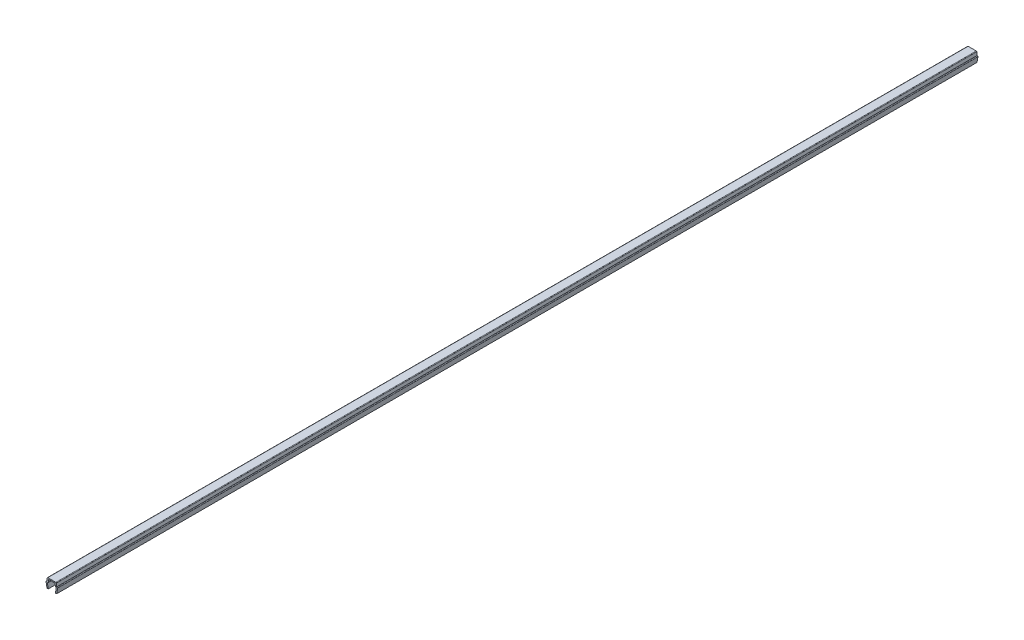
ISO-10303-21;
HEADER;
FILE_DESCRIPTION(('STEP AP214'),'2;1');
FILE_NAME('part.step','',(''),(''),'','','');
FILE_SCHEMA(('AUTOMOTIVE_DESIGN { 1 0 10303 214 1 1 1 1 }'));
ENDSEC;
DATA;
#1=APPLICATION_CONTEXT('core data for automotive mechanical design processes');
#2=APPLICATION_PROTOCOL_DEFINITION('international standard','automotive_design',2000,#1);
#3=PRODUCT_CONTEXT('',#1,'mechanical');
#4=PRODUCT('Part','Part','',(#3));
#5=PRODUCT_RELATED_PRODUCT_CATEGORY('part','',(#4));
#6=PRODUCT_DEFINITION_FORMATION('','',#4);
#7=PRODUCT_DEFINITION_CONTEXT('part definition',#1,'design');
#8=PRODUCT_DEFINITION('design','',#6,#7);
#9=PRODUCT_DEFINITION_SHAPE('','',#8);
#10=(LENGTH_UNIT() NAMED_UNIT(*) SI_UNIT(.MILLI.,.METRE.));
#11=(NAMED_UNIT(*) PLANE_ANGLE_UNIT() SI_UNIT($,.RADIAN.));
#12=(NAMED_UNIT(*) SI_UNIT($,.STERADIAN.) SOLID_ANGLE_UNIT());
#13=UNCERTAINTY_MEASURE_WITH_UNIT(LENGTH_MEASURE(1.E-05),#10,'distance_accuracy_value','');
#14=(GEOMETRIC_REPRESENTATION_CONTEXT(3) GLOBAL_UNCERTAINTY_ASSIGNED_CONTEXT((#13)) GLOBAL_UNIT_ASSIGNED_CONTEXT((#10,
#11,#12)) REPRESENTATION_CONTEXT('',''));
#15=CARTESIAN_POINT('',(0.,0.,0.));
#16=DIRECTION('',(0.,0.,1.));
#17=DIRECTION('',(1.,0.,0.));
#18=AXIS2_PLACEMENT_3D('',#15,#16,#17);
#19=CARTESIAN_POINT('',(-3.25000000000003,3.35000000000003,284.75));
#20=DIRECTION('',(0.,0.,-1.));
#21=DIRECTION('',(-1.,0.,0.));
#22=AXIS2_PLACEMENT_3D('',#19,#20,#21);
#23=CYLINDRICAL_SURFACE('',#22,0.349999999999972);
#24=DIRECTION('',(0.,0.,-1.));
#25=VECTOR('',#24,1.);
#26=CARTESIAN_POINT('',(-3.25,3.7,284.75));
#27=LINE('',#26,#25);
#28=CARTESIAN_POINT('',(-3.25,3.7,284.75));
#29=VERTEX_POINT('',#28);
#30=CARTESIAN_POINT('',(-3.25,3.7,-284.75));
#31=VERTEX_POINT('',#30);
#32=EDGE_CURVE('E211',#29,#31,#27,.T.);
#33=ORIENTED_EDGE('',*,*,#32,.T.);
#34=CARTESIAN_POINT('',(-3.25000000000003,3.35000000000003,-284.75));
#35=DIRECTION('',(0.,0.,1.));
#36=DIRECTION('',(1.,0.,0.));
#37=AXIS2_PLACEMENT_3D('',#34,#35,#36);
#38=CIRCLE('',#37,0.349999999999972);
#39=CARTESIAN_POINT('',(-3.6,3.35,-284.75));
#40=VERTEX_POINT('',#39);
#41=EDGE_CURVE('E205',#31,#40,#38,.T.);
#42=ORIENTED_EDGE('',*,*,#41,.T.);
#43=DIRECTION('',(0.,0.,-1.));
#44=VECTOR('',#43,1.);
#45=CARTESIAN_POINT('',(-3.6,3.35,284.75));
#46=LINE('',#45,#44);
#47=CARTESIAN_POINT('',(-3.6,3.35,284.75));
#48=VERTEX_POINT('',#47);
#49=EDGE_CURVE('E11',#48,#40,#46,.T.);
#50=ORIENTED_EDGE('',*,*,#49,.F.);
#51=CARTESIAN_POINT('',(-3.25000000000003,3.35000000000003,284.75));
#52=DIRECTION('',(0.,0.,1.));
#53=DIRECTION('',(1.,0.,0.));
#54=AXIS2_PLACEMENT_3D('',#51,#52,#53);
#55=CIRCLE('',#54,0.349999999999972);
#56=EDGE_CURVE('E277',#29,#48,#55,.T.);
#57=ORIENTED_EDGE('',*,*,#56,.F.);
#58=EDGE_LOOP('',(#33,#42,#50,#57));
#59=FACE_BOUND('',#58,.T.);
#60=ADVANCED_FACE('F33',(#59),#23,.T.);
#61=CARTESIAN_POINT('',(-3.6,3.35,284.75));
#62=DIRECTION('',(0.984336643247304,0.176299100283099,0.));
#63=DIRECTION('',(-0.176299100283099,0.984336643247304,0.));
#64=AXIS2_PLACEMENT_3D('',#61,#62,#63);
#65=PLANE('',#64);
#66=ORIENTED_EDGE('',*,*,#49,.T.);
#67=DIRECTION('',(0.176299100283099,-0.984336643247304,0.));
#68=VECTOR('',#67,1.);
#69=CARTESIAN_POINT('',(-3.6,3.35,-284.75));
#70=LINE('',#69,#68);
#71=CARTESIAN_POINT('',(-3.,0.,-284.75));
#72=VERTEX_POINT('',#71);
#73=EDGE_CURVE('E195',#40,#72,#70,.T.);
#74=ORIENTED_EDGE('',*,*,#73,.T.);
#75=DIRECTION('',(0.,0.,-1.));
#76=VECTOR('',#75,1.);
#77=CARTESIAN_POINT('',(-3.,0.,284.75));
#78=LINE('',#77,#76);
#79=CARTESIAN_POINT('',(-3.,0.,284.75));
#80=VERTEX_POINT('',#79);
#81=EDGE_CURVE('E40',#80,#72,#78,.T.);
#82=ORIENTED_EDGE('',*,*,#81,.F.);
#83=DIRECTION('',(0.176299100283099,-0.984336643247304,0.));
#84=VECTOR('',#83,1.);
#85=CARTESIAN_POINT('',(-3.6,3.35,284.75));
#86=LINE('',#85,#84);
#87=EDGE_CURVE('E196',#48,#80,#86,.T.);
#88=ORIENTED_EDGE('',*,*,#87,.F.);
#89=EDGE_LOOP('',(#66,#74,#82,#88));
#90=FACE_BOUND('',#89,.T.);
#91=ADVANCED_FACE('F193',(#90),#65,.F.);
#92=CARTESIAN_POINT('',(-3.,0.,284.75));
#93=DIRECTION('',(0.,1.,0.));
#94=DIRECTION('',(0.,0.,1.));
#95=AXIS2_PLACEMENT_3D('',#92,#93,#94);
#96=PLANE('',#95);
#97=ORIENTED_EDGE('',*,*,#81,.T.);
#98=DIRECTION('',(1.,0.,0.));
#99=VECTOR('',#98,1.);
#100=CARTESIAN_POINT('',(-3.,0.,-284.75));
#101=LINE('',#100,#99);
#102=CARTESIAN_POINT('',(-2.2,0.,-284.75));
#103=VERTEX_POINT('',#102);
#104=EDGE_CURVE('E209',#72,#103,#101,.T.);
#105=ORIENTED_EDGE('',*,*,#104,.T.);
#106=DIRECTION('',(0.,0.,-1.));
#107=VECTOR('',#106,1.);
#108=CARTESIAN_POINT('',(-2.2,0.,284.75));
#109=LINE('',#108,#107);
#110=CARTESIAN_POINT('',(-2.2,0.,284.75));
#111=VERTEX_POINT('',#110);
#112=EDGE_CURVE('E363',#111,#103,#109,.T.);
#113=ORIENTED_EDGE('',*,*,#112,.F.);
#114=DIRECTION('',(1.,0.,0.));
#115=VECTOR('',#114,1.);
#116=CARTESIAN_POINT('',(-3.,0.,284.75));
#117=LINE('',#116,#115);
#118=EDGE_CURVE('E280',#80,#111,#117,.T.);
#119=ORIENTED_EDGE('',*,*,#118,.F.);
#120=EDGE_LOOP('',(#97,#105,#113,#119));
#121=FACE_BOUND('',#120,.T.);
#122=ADVANCED_FACE('F366',(#121),#96,.F.);
#123=CARTESIAN_POINT('',(-2.2,0.,284.75));
#124=DIRECTION('',(-0.984336643247306,-0.176299100283088,0.));
#125=DIRECTION('',(0.176299100283088,-0.984336643247306,0.));
#126=AXIS2_PLACEMENT_3D('',#123,#124,#125);
#127=PLANE('',#126);
#128=ORIENTED_EDGE('',*,*,#112,.T.);
#129=DIRECTION('',(-0.176299100283088,0.984336643247306,0.));
#130=VECTOR('',#129,1.);
#131=CARTESIAN_POINT('',(-2.2,0.,-284.75));
#132=LINE('',#131,#130);
#133=CARTESIAN_POINT('',(-2.7352170713255,2.9882953149009,-284.75));
#134=VERTEX_POINT('',#133);
#135=EDGE_CURVE('E215',#103,#134,#132,.T.);
#136=ORIENTED_EDGE('',*,*,#135,.T.);
#137=DIRECTION('',(0.,0.,-1.));
#138=VECTOR('',#137,1.);
#139=CARTESIAN_POINT('',(-2.7352170713255,2.9882953149009,284.75));
#140=LINE('',#139,#138);
#141=CARTESIAN_POINT('',(-2.7352170713255,2.9882953149009,284.75));
#142=VERTEX_POINT('',#141);
#143=EDGE_CURVE('E361',#142,#134,#140,.T.);
#144=ORIENTED_EDGE('',*,*,#143,.F.);
#145=DIRECTION('',(-0.176299100283088,0.984336643247306,0.));
#146=VECTOR('',#145,1.);
#147=CARTESIAN_POINT('',(-2.2,0.,284.75));
#148=LINE('',#147,#146);
#149=EDGE_CURVE('E282',#111,#142,#148,.T.);
#150=ORIENTED_EDGE('',*,*,#149,.F.);
#151=EDGE_LOOP('',(#128,#136,#144,#150));
#152=FACE_BOUND('',#151,.T.);
#153=ADVANCED_FACE('F374',(#152),#127,.F.);
#154=CARTESIAN_POINT('',(-2.390699246189,3.05000000000004,284.75));
#155=DIRECTION('',(0.,0.,-1.));
#156=DIRECTION('',(-1.,0.,0.));
#157=AXIS2_PLACEMENT_3D('',#154,#155,#156);
#158=CYLINDRICAL_SURFACE('',#157,0.349999999999955);
#159=ORIENTED_EDGE('',*,*,#143,.T.);
#160=CARTESIAN_POINT('',(-2.390699246189,3.05000000000004,-284.75));
#161=DIRECTION('',(0.,0.,-1.));
#162=DIRECTION('',(-1.,0.,0.));
#163=AXIS2_PLACEMENT_3D('',#160,#161,#162);
#164=CIRCLE('',#163,0.349999999999955);
#165=CARTESIAN_POINT('',(-2.390699246189,3.4,-284.75));
#166=VERTEX_POINT('',#165);
#167=EDGE_CURVE('E218',#134,#166,#164,.T.);
#168=ORIENTED_EDGE('',*,*,#167,.T.);
#169=DIRECTION('',(0.,0.,-1.));
#170=VECTOR('',#169,1.);
#171=CARTESIAN_POINT('',(-2.390699246189,3.4,284.75));
#172=LINE('',#171,#170);
#173=CARTESIAN_POINT('',(-2.390699246189,3.4,284.75));
#174=VERTEX_POINT('',#173);
#175=EDGE_CURVE('E359',#174,#166,#172,.T.);
#176=ORIENTED_EDGE('',*,*,#175,.F.);
#177=CARTESIAN_POINT('',(-2.390699246189,3.05000000000004,284.75));
#178=DIRECTION('',(0.,0.,-1.));
#179=DIRECTION('',(-1.,0.,0.));
#180=AXIS2_PLACEMENT_3D('',#177,#178,#179);
#181=CIRCLE('',#180,0.349999999999955);
#182=EDGE_CURVE('E284',#142,#174,#181,.T.);
#183=ORIENTED_EDGE('',*,*,#182,.F.);
#184=EDGE_LOOP('',(#159,#168,#176,#183));
#185=FACE_BOUND('',#184,.T.);
#186=ADVANCED_FACE('F377',(#185),#158,.F.);
#187=CARTESIAN_POINT('',(-2.390699246189,3.4,284.75));
#188=DIRECTION('',(0.,1.,0.));
#189=DIRECTION('',(0.,0.,1.));
#190=AXIS2_PLACEMENT_3D('',#187,#188,#189);
#191=PLANE('',#190);
#192=ORIENTED_EDGE('',*,*,#175,.T.);
#193=DIRECTION('',(1.,0.,0.));
#194=VECTOR('',#193,1.);
#195=CARTESIAN_POINT('',(-2.390699246189,3.4,-284.75));
#196=LINE('',#195,#194);
#197=CARTESIAN_POINT('',(-2.2,3.4,-284.75));
#198=VERTEX_POINT('',#197);
#199=EDGE_CURVE('E221',#166,#198,#196,.T.);
#200=ORIENTED_EDGE('',*,*,#199,.T.);
#201=DIRECTION('',(0.,0.,-1.));
#202=VECTOR('',#201,1.);
#203=CARTESIAN_POINT('',(-2.2,3.4,284.75));
#204=LINE('',#203,#202);
#205=CARTESIAN_POINT('',(-2.2,3.4,284.75));
#206=VERTEX_POINT('',#205);
#207=EDGE_CURVE('E357',#206,#198,#204,.T.);
#208=ORIENTED_EDGE('',*,*,#207,.F.);
#209=DIRECTION('',(1.,0.,0.));
#210=VECTOR('',#209,1.);
#211=CARTESIAN_POINT('',(-2.390699246189,3.4,284.75));
#212=LINE('',#211,#210);
#213=EDGE_CURVE('E286',#174,#206,#212,.T.);
#214=ORIENTED_EDGE('',*,*,#213,.F.);
#215=EDGE_LOOP('',(#192,#200,#208,#214));
#216=FACE_BOUND('',#215,.T.);
#217=ADVANCED_FACE('F382',(#216),#191,.F.);
#218=CARTESIAN_POINT('',(-2.2,3.4,284.75));
#219=DIRECTION('',(-0.996194698091743,0.08715574274769,0.));
#220=DIRECTION('',(-0.08715574274769,-0.996194698091743,0.));
#221=AXIS2_PLACEMENT_3D('',#218,#219,#220);
#222=PLANE('',#221);
#223=ORIENTED_EDGE('',*,*,#207,.T.);
#224=DIRECTION('',(0.08715574274769,0.996194698091743,0.));
#225=VECTOR('',#224,1.);
#226=CARTESIAN_POINT('',(-2.2,3.4,-284.75));
#227=LINE('',#226,#225);
#228=CARTESIAN_POINT('',(-2.0704726390793,4.8805045099617,-284.75));
#229=VERTEX_POINT('',#228);
#230=EDGE_CURVE('E224',#198,#229,#227,.T.);
#231=ORIENTED_EDGE('',*,*,#230,.T.);
#232=DIRECTION('',(0.,0.,-1.));
#233=VECTOR('',#232,1.);
#234=CARTESIAN_POINT('',(-2.0704726390793,4.8805045099617,284.75));
#235=LINE('',#234,#233);
#236=CARTESIAN_POINT('',(-2.0704726390793,4.8805045099617,284.75));
#237=VERTEX_POINT('',#236);
#238=EDGE_CURVE('E355',#237,#229,#235,.T.);
#239=ORIENTED_EDGE('',*,*,#238,.F.);
#240=DIRECTION('',(0.08715574274769,0.996194698091743,0.));
#241=VECTOR('',#240,1.);
#242=CARTESIAN_POINT('',(-2.2,3.4,284.75));
#243=LINE('',#242,#241);
#244=EDGE_CURVE('E288',#206,#237,#243,.T.);
#245=ORIENTED_EDGE('',*,*,#244,.F.);
#246=EDGE_LOOP('',(#223,#231,#239,#245));
#247=FACE_BOUND('',#246,.T.);
#248=ADVANCED_FACE('F388',(#247),#222,.F.);
#249=CARTESIAN_POINT('',(-1.72180449474716,4.84999999999996,284.75));
#250=DIRECTION('',(0.,0.,-1.));
#251=DIRECTION('',(-1.,0.,0.));
#252=AXIS2_PLACEMENT_3D('',#249,#250,#251);
#253=CYLINDRICAL_SURFACE('',#252,0.350000000000036);
#254=ORIENTED_EDGE('',*,*,#238,.T.);
#255=CARTESIAN_POINT('',(-1.72180449474716,4.84999999999996,-284.75));
#256=DIRECTION('',(0.,0.,-1.));
#257=DIRECTION('',(-1.,0.,0.));
#258=AXIS2_PLACEMENT_3D('',#255,#256,#257);
#259=CIRCLE('',#258,0.350000000000036);
#260=CARTESIAN_POINT('',(-1.7218044947472,5.2,-284.75));
#261=VERTEX_POINT('',#260);
#262=EDGE_CURVE('E227',#229,#261,#259,.T.);
#263=ORIENTED_EDGE('',*,*,#262,.T.);
#264=DIRECTION('',(0.,0.,-1.));
#265=VECTOR('',#264,1.);
#266=CARTESIAN_POINT('',(-1.7218044947472,5.2,284.75));
#267=LINE('',#266,#265);
#268=CARTESIAN_POINT('',(-1.7218044947472,5.2,284.75));
#269=VERTEX_POINT('',#268);
#270=EDGE_CURVE('E353',#269,#261,#267,.T.);
#271=ORIENTED_EDGE('',*,*,#270,.F.);
#272=CARTESIAN_POINT('',(-1.72180449474716,4.84999999999996,284.75));
#273=DIRECTION('',(0.,0.,-1.));
#274=DIRECTION('',(-1.,0.,0.));
#275=AXIS2_PLACEMENT_3D('',#272,#273,#274);
#276=CIRCLE('',#275,0.350000000000036);
#277=EDGE_CURVE('E290',#237,#269,#276,.T.);
#278=ORIENTED_EDGE('',*,*,#277,.F.);
#279=EDGE_LOOP('',(#254,#263,#271,#278));
#280=FACE_BOUND('',#279,.T.);
#281=ADVANCED_FACE('F392',(#280),#253,.F.);
#282=CARTESIAN_POINT('',(-1.7218044947472,5.2,284.75));
#283=DIRECTION('',(0.,1.,0.));
#284=DIRECTION('',(0.,0.,1.));
#285=AXIS2_PLACEMENT_3D('',#282,#283,#284);
#286=PLANE('',#285);
#287=ORIENTED_EDGE('',*,*,#270,.T.);
#288=DIRECTION('',(1.,0.,0.));
#289=VECTOR('',#288,1.);
#290=CARTESIAN_POINT('',(-1.7218044947472,5.2,-284.75));
#291=LINE('',#290,#289);
#292=CARTESIAN_POINT('',(1.7218044947472,5.2,-284.75));
#293=VERTEX_POINT('',#292);
#294=EDGE_CURVE('E230',#261,#293,#291,.T.);
#295=ORIENTED_EDGE('',*,*,#294,.T.);
#296=DIRECTION('',(0.,0.,-1.));
#297=VECTOR('',#296,1.);
#298=CARTESIAN_POINT('',(1.7218044947472,5.2,284.75));
#299=LINE('',#298,#297);
#300=CARTESIAN_POINT('',(1.7218044947472,5.2,284.75));
#301=VERTEX_POINT('',#300);
#302=EDGE_CURVE('E351',#301,#293,#299,.T.);
#303=ORIENTED_EDGE('',*,*,#302,.F.);
#304=DIRECTION('',(1.,0.,0.));
#305=VECTOR('',#304,1.);
#306=CARTESIAN_POINT('',(-1.7218044947472,5.2,284.75));
#307=LINE('',#306,#305);
#308=EDGE_CURVE('E292',#269,#301,#307,.T.);
#309=ORIENTED_EDGE('',*,*,#308,.F.);
#310=EDGE_LOOP('',(#287,#295,#303,#309));
#311=FACE_BOUND('',#310,.T.);
#312=ADVANCED_FACE('F397',(#311),#286,.F.);
#313=CARTESIAN_POINT('',(1.72180449474716,4.84999999999996,284.75));
#314=DIRECTION('',(0.,0.,-1.));
#315=DIRECTION('',(-1.,0.,0.));
#316=AXIS2_PLACEMENT_3D('',#313,#314,#315);
#317=CYLINDRICAL_SURFACE('',#316,0.350000000000036);
#318=ORIENTED_EDGE('',*,*,#302,.T.);
#319=CARTESIAN_POINT('',(1.72180449474716,4.84999999999996,-284.75));
#320=DIRECTION('',(0.,0.,-1.));
#321=DIRECTION('',(-1.,0.,0.));
#322=AXIS2_PLACEMENT_3D('',#319,#320,#321);
#323=CIRCLE('',#322,0.350000000000036);
#324=CARTESIAN_POINT('',(2.0704726390793,4.8805045099617,-284.75));
#325=VERTEX_POINT('',#324);
#326=EDGE_CURVE('E233',#293,#325,#323,.T.);
#327=ORIENTED_EDGE('',*,*,#326,.T.);
#328=DIRECTION('',(0.,0.,-1.));
#329=VECTOR('',#328,1.);
#330=CARTESIAN_POINT('',(2.0704726390793,4.8805045099617,284.75));
#331=LINE('',#330,#329);
#332=CARTESIAN_POINT('',(2.0704726390793,4.8805045099617,284.75));
#333=VERTEX_POINT('',#332);
#334=EDGE_CURVE('E349',#333,#325,#331,.T.);
#335=ORIENTED_EDGE('',*,*,#334,.F.);
#336=CARTESIAN_POINT('',(1.72180449474716,4.84999999999996,284.75));
#337=DIRECTION('',(0.,0.,-1.));
#338=DIRECTION('',(-1.,0.,0.));
#339=AXIS2_PLACEMENT_3D('',#336,#337,#338);
#340=CIRCLE('',#339,0.350000000000036);
#341=EDGE_CURVE('E294',#301,#333,#340,.T.);
#342=ORIENTED_EDGE('',*,*,#341,.F.);
#343=EDGE_LOOP('',(#318,#327,#335,#342));
#344=FACE_BOUND('',#343,.T.);
#345=ADVANCED_FACE('F403',(#344),#317,.F.);
#346=CARTESIAN_POINT('',(2.0704726390793,4.8805045099617,284.75));
#347=DIRECTION('',(0.996194698091743,0.08715574274769,0.));
#348=DIRECTION('',(-0.08715574274769,0.996194698091743,0.));
#349=AXIS2_PLACEMENT_3D('',#346,#347,#348);
#350=PLANE('',#349);
#351=ORIENTED_EDGE('',*,*,#334,.T.);
#352=DIRECTION('',(0.08715574274769,-0.996194698091743,0.));
#353=VECTOR('',#352,1.);
#354=CARTESIAN_POINT('',(2.0704726390793,4.8805045099617,-284.75));
#355=LINE('',#354,#353);
#356=CARTESIAN_POINT('',(2.2,3.4,-284.75));
#357=VERTEX_POINT('',#356);
#358=EDGE_CURVE('E236',#325,#357,#355,.T.);
#359=ORIENTED_EDGE('',*,*,#358,.T.);
#360=DIRECTION('',(0.,0.,-1.));
#361=VECTOR('',#360,1.);
#362=CARTESIAN_POINT('',(2.2,3.4,284.75));
#363=LINE('',#362,#361);
#364=CARTESIAN_POINT('',(2.2,3.4,284.75));
#365=VERTEX_POINT('',#364);
#366=EDGE_CURVE('E347',#365,#357,#363,.T.);
#367=ORIENTED_EDGE('',*,*,#366,.F.);
#368=DIRECTION('',(0.08715574274769,-0.996194698091743,0.));
#369=VECTOR('',#368,1.);
#370=CARTESIAN_POINT('',(2.0704726390793,4.8805045099617,284.75));
#371=LINE('',#370,#369);
#372=EDGE_CURVE('E296',#333,#365,#371,.T.);
#373=ORIENTED_EDGE('',*,*,#372,.F.);
#374=EDGE_LOOP('',(#351,#359,#367,#373));
#375=FACE_BOUND('',#374,.T.);
#376=ADVANCED_FACE('F407',(#375),#350,.F.);
#377=CARTESIAN_POINT('',(2.2,3.4,284.75));
#378=DIRECTION('',(0.,1.,0.));
#379=DIRECTION('',(0.,0.,1.));
#380=AXIS2_PLACEMENT_3D('',#377,#378,#379);
#381=PLANE('',#380);
#382=ORIENTED_EDGE('',*,*,#366,.T.);
#383=DIRECTION('',(1.,0.,0.));
#384=VECTOR('',#383,1.);
#385=CARTESIAN_POINT('',(2.2,3.4,-284.75));
#386=LINE('',#385,#384);
#387=CARTESIAN_POINT('',(2.390699246189,3.4,-284.75));
#388=VERTEX_POINT('',#387);
#389=EDGE_CURVE('E239',#357,#388,#386,.T.);
#390=ORIENTED_EDGE('',*,*,#389,.T.);
#391=DIRECTION('',(0.,0.,-1.));
#392=VECTOR('',#391,1.);
#393=CARTESIAN_POINT('',(2.390699246189,3.4,284.75));
#394=LINE('',#393,#392);
#395=CARTESIAN_POINT('',(2.390699246189,3.4,284.75));
#396=VERTEX_POINT('',#395);
#397=EDGE_CURVE('E345',#396,#388,#394,.T.);
#398=ORIENTED_EDGE('',*,*,#397,.F.);
#399=DIRECTION('',(1.,0.,0.));
#400=VECTOR('',#399,1.);
#401=CARTESIAN_POINT('',(2.2,3.4,284.75));
#402=LINE('',#401,#400);
#403=EDGE_CURVE('E298',#365,#396,#402,.T.);
#404=ORIENTED_EDGE('',*,*,#403,.F.);
#405=EDGE_LOOP('',(#382,#390,#398,#404));
#406=FACE_BOUND('',#405,.T.);
#407=ADVANCED_FACE('F412',(#406),#381,.F.);
#408=CARTESIAN_POINT('',(2.390699246189,3.05000000000004,284.75));
#409=DIRECTION('',(0.,0.,-1.));
#410=DIRECTION('',(-1.,0.,0.));
#411=AXIS2_PLACEMENT_3D('',#408,#409,#410);
#412=CYLINDRICAL_SURFACE('',#411,0.349999999999955);
#413=ORIENTED_EDGE('',*,*,#397,.T.);
#414=CARTESIAN_POINT('',(2.390699246189,3.05000000000004,-284.75));
#415=DIRECTION('',(0.,0.,-1.));
#416=DIRECTION('',(-1.,0.,0.));
#417=AXIS2_PLACEMENT_3D('',#414,#415,#416);
#418=CIRCLE('',#417,0.349999999999955);
#419=CARTESIAN_POINT('',(2.7352170713255,2.9882953149009,-284.75));
#420=VERTEX_POINT('',#419);
#421=EDGE_CURVE('E242',#388,#420,#418,.T.);
#422=ORIENTED_EDGE('',*,*,#421,.T.);
#423=DIRECTION('',(0.,0.,-1.));
#424=VECTOR('',#423,1.);
#425=CARTESIAN_POINT('',(2.7352170713255,2.9882953149009,284.75));
#426=LINE('',#425,#424);
#427=CARTESIAN_POINT('',(2.7352170713255,2.9882953149009,284.75));
#428=VERTEX_POINT('',#427);
#429=EDGE_CURVE('E343',#428,#420,#426,.T.);
#430=ORIENTED_EDGE('',*,*,#429,.F.);
#431=CARTESIAN_POINT('',(2.390699246189,3.05000000000004,284.75));
#432=DIRECTION('',(0.,0.,-1.));
#433=DIRECTION('',(-1.,0.,0.));
#434=AXIS2_PLACEMENT_3D('',#431,#432,#433);
#435=CIRCLE('',#434,0.349999999999955);
#436=EDGE_CURVE('E300',#396,#428,#435,.T.);
#437=ORIENTED_EDGE('',*,*,#436,.F.);
#438=EDGE_LOOP('',(#413,#422,#430,#437));
#439=FACE_BOUND('',#438,.T.);
#440=ADVANCED_FACE('F418',(#439),#412,.F.);
#441=CARTESIAN_POINT('',(2.7352170713255,2.9882953149009,284.75));
#442=DIRECTION('',(0.984336643247306,-0.176299100283088,0.));
#443=DIRECTION('',(0.176299100283088,0.984336643247306,0.));
#444=AXIS2_PLACEMENT_3D('',#441,#442,#443);
#445=PLANE('',#444);
#446=ORIENTED_EDGE('',*,*,#429,.T.);
#447=DIRECTION('',(-0.176299100283088,-0.984336643247306,0.));
#448=VECTOR('',#447,1.);
#449=CARTESIAN_POINT('',(2.7352170713255,2.9882953149009,-284.75));
#450=LINE('',#449,#448);
#451=CARTESIAN_POINT('',(2.2,0.,-284.75));
#452=VERTEX_POINT('',#451);
#453=EDGE_CURVE('E245',#420,#452,#450,.T.);
#454=ORIENTED_EDGE('',*,*,#453,.T.);
#455=DIRECTION('',(0.,0.,-1.));
#456=VECTOR('',#455,1.);
#457=CARTESIAN_POINT('',(2.2,0.,284.75));
#458=LINE('',#457,#456);
#459=CARTESIAN_POINT('',(2.2,0.,284.75));
#460=VERTEX_POINT('',#459);
#461=EDGE_CURVE('E341',#460,#452,#458,.T.);
#462=ORIENTED_EDGE('',*,*,#461,.F.);
#463=DIRECTION('',(-0.176299100283088,-0.984336643247306,0.));
#464=VECTOR('',#463,1.);
#465=CARTESIAN_POINT('',(2.7352170713255,2.9882953149009,284.75));
#466=LINE('',#465,#464);
#467=EDGE_CURVE('E302',#428,#460,#466,.T.);
#468=ORIENTED_EDGE('',*,*,#467,.F.);
#469=EDGE_LOOP('',(#446,#454,#462,#468));
#470=FACE_BOUND('',#469,.T.);
#471=ADVANCED_FACE('F422',(#470),#445,.F.);
#472=CARTESIAN_POINT('',(2.2,0.,284.75));
#473=DIRECTION('',(0.,1.,0.));
#474=DIRECTION('',(0.,0.,1.));
#475=AXIS2_PLACEMENT_3D('',#472,#473,#474);
#476=PLANE('',#475);
#477=ORIENTED_EDGE('',*,*,#461,.T.);
#478=DIRECTION('',(1.,0.,0.));
#479=VECTOR('',#478,1.);
#480=CARTESIAN_POINT('',(2.2,0.,-284.75));
#481=LINE('',#480,#479);
#482=CARTESIAN_POINT('',(3.,0.,-284.75));
#483=VERTEX_POINT('',#482);
#484=EDGE_CURVE('E248',#452,#483,#481,.T.);
#485=ORIENTED_EDGE('',*,*,#484,.T.);
#486=DIRECTION('',(0.,0.,-1.));
#487=VECTOR('',#486,1.);
#488=CARTESIAN_POINT('',(3.,0.,284.75));
#489=LINE('',#488,#487);
#490=CARTESIAN_POINT('',(3.,0.,284.75));
#491=VERTEX_POINT('',#490);
#492=EDGE_CURVE('E339',#491,#483,#489,.T.);
#493=ORIENTED_EDGE('',*,*,#492,.F.);
#494=DIRECTION('',(1.,0.,0.));
#495=VECTOR('',#494,1.);
#496=CARTESIAN_POINT('',(2.2,0.,284.75));
#497=LINE('',#496,#495);
#498=EDGE_CURVE('E304',#460,#491,#497,.T.);
#499=ORIENTED_EDGE('',*,*,#498,.F.);
#500=EDGE_LOOP('',(#477,#485,#493,#499));
#501=FACE_BOUND('',#500,.T.);
#502=ADVANCED_FACE('F427',(#501),#476,.F.);
#503=CARTESIAN_POINT('',(3.,0.,284.75));
#504=DIRECTION('',(-0.984336643247304,0.176299100283099,0.));
#505=DIRECTION('',(-0.176299100283099,-0.984336643247304,0.));
#506=AXIS2_PLACEMENT_3D('',#503,#504,#505);
#507=PLANE('',#506);
#508=ORIENTED_EDGE('',*,*,#492,.T.);
#509=DIRECTION('',(0.176299100283099,0.984336643247304,0.));
#510=VECTOR('',#509,1.);
#511=CARTESIAN_POINT('',(3.,0.,-284.75));
#512=LINE('',#511,#510);
#513=CARTESIAN_POINT('',(3.6,3.35,-284.75));
#514=VERTEX_POINT('',#513);
#515=EDGE_CURVE('E251',#483,#514,#512,.T.);
#516=ORIENTED_EDGE('',*,*,#515,.T.);
#517=DIRECTION('',(0.,0.,-1.));
#518=VECTOR('',#517,1.);
#519=CARTESIAN_POINT('',(3.6,3.35,284.75));
#520=LINE('',#519,#518);
#521=CARTESIAN_POINT('',(3.6,3.35,284.75));
#522=VERTEX_POINT('',#521);
#523=EDGE_CURVE('E337',#522,#514,#520,.T.);
#524=ORIENTED_EDGE('',*,*,#523,.F.);
#525=DIRECTION('',(0.176299100283099,0.984336643247304,0.));
#526=VECTOR('',#525,1.);
#527=CARTESIAN_POINT('',(3.,0.,284.75));
#528=LINE('',#527,#526);
#529=EDGE_CURVE('E306',#491,#522,#528,.T.);
#530=ORIENTED_EDGE('',*,*,#529,.F.);
#531=EDGE_LOOP('',(#508,#516,#524,#530));
#532=FACE_BOUND('',#531,.T.);
#533=ADVANCED_FACE('F433',(#532),#507,.F.);
#534=CARTESIAN_POINT('',(3.25000000000003,3.35000000000003,284.75));
#535=DIRECTION('',(0.,0.,-1.));
#536=DIRECTION('',(-1.,0.,0.));
#537=AXIS2_PLACEMENT_3D('',#534,#535,#536);
#538=CYLINDRICAL_SURFACE('',#537,0.349999999999972);
#539=ORIENTED_EDGE('',*,*,#523,.T.);
#540=CARTESIAN_POINT('',(3.25000000000003,3.35000000000003,-284.75));
#541=DIRECTION('',(0.,0.,1.));
#542=DIRECTION('',(1.,0.,0.));
#543=AXIS2_PLACEMENT_3D('',#540,#541,#542);
#544=CIRCLE('',#543,0.349999999999972);
#545=CARTESIAN_POINT('',(3.25,3.7,-284.75));
#546=VERTEX_POINT('',#545);
#547=EDGE_CURVE('E254',#514,#546,#544,.T.);
#548=ORIENTED_EDGE('',*,*,#547,.T.);
#549=DIRECTION('',(0.,0.,-1.));
#550=VECTOR('',#549,1.);
#551=CARTESIAN_POINT('',(3.25,3.7,284.75));
#552=LINE('',#551,#550);
#553=CARTESIAN_POINT('',(3.25,3.7,284.75));
#554=VERTEX_POINT('',#553);
#555=EDGE_CURVE('E335',#554,#546,#552,.T.);
#556=ORIENTED_EDGE('',*,*,#555,.F.);
#557=CARTESIAN_POINT('',(3.25000000000003,3.35000000000003,284.75));
#558=DIRECTION('',(0.,0.,1.));
#559=DIRECTION('',(1.,0.,0.));
#560=AXIS2_PLACEMENT_3D('',#557,#558,#559);
#561=CIRCLE('',#560,0.349999999999972);
#562=EDGE_CURVE('E308',#522,#554,#561,.T.);
#563=ORIENTED_EDGE('',*,*,#562,.F.);
#564=EDGE_LOOP('',(#539,#548,#556,#563));
#565=FACE_BOUND('',#564,.T.);
#566=ADVANCED_FACE('F437',(#565),#538,.T.);
#567=CARTESIAN_POINT('',(3.25,3.7,284.75));
#568=DIRECTION('',(0.,-1.,0.));
#569=DIRECTION('',(0.,0.,-1.));
#570=AXIS2_PLACEMENT_3D('',#567,#568,#569);
#571=PLANE('',#570);
#572=ORIENTED_EDGE('',*,*,#555,.T.);
#573=DIRECTION('',(-1.,0.,0.));
#574=VECTOR('',#573,1.);
#575=CARTESIAN_POINT('',(3.25,3.7,-284.75));
#576=LINE('',#575,#574);
#577=CARTESIAN_POINT('',(3.,3.7,-284.75));
#578=VERTEX_POINT('',#577);
#579=EDGE_CURVE('E257',#546,#578,#576,.T.);
#580=ORIENTED_EDGE('',*,*,#579,.T.);
#581=DIRECTION('',(0.,0.,-1.));
#582=VECTOR('',#581,1.);
#583=CARTESIAN_POINT('',(3.,3.7,284.75));
#584=LINE('',#583,#582);
#585=CARTESIAN_POINT('',(3.,3.7,284.75));
#586=VERTEX_POINT('',#585);
#587=EDGE_CURVE('E333',#586,#578,#584,.T.);
#588=ORIENTED_EDGE('',*,*,#587,.F.);
#589=DIRECTION('',(-1.,0.,0.));
#590=VECTOR('',#589,1.);
#591=CARTESIAN_POINT('',(3.25,3.7,284.75));
#592=LINE('',#591,#590);
#593=EDGE_CURVE('E310',#554,#586,#592,.T.);
#594=ORIENTED_EDGE('',*,*,#593,.F.);
#595=EDGE_LOOP('',(#572,#580,#588,#594));
#596=FACE_BOUND('',#595,.T.);
#597=ADVANCED_FACE('F442',(#596),#571,.F.);
#598=CARTESIAN_POINT('',(3.,3.7,284.75));
#599=DIRECTION('',(-0.996194698091746,-0.0871557427476467,0.));
#600=DIRECTION('',(0.0871557427476467,-0.996194698091747,0.));
#601=AXIS2_PLACEMENT_3D('',#598,#599,#600);
#602=PLANE('',#601);
#603=ORIENTED_EDGE('',*,*,#587,.T.);
#604=DIRECTION('',(-0.0871557427476467,0.996194698091747,0.));
#605=VECTOR('',#604,1.);
#606=CARTESIAN_POINT('',(3.,3.7,-284.75));
#607=LINE('',#606,#605);
#608=CARTESIAN_POINT('',(2.835477173669,5.5805045099617,-284.75));
#609=VERTEX_POINT('',#608);
#610=EDGE_CURVE('E260',#578,#609,#607,.T.);
#611=ORIENTED_EDGE('',*,*,#610,.T.);
#612=DIRECTION('',(0.,0.,-1.));
#613=VECTOR('',#612,1.);
#614=CARTESIAN_POINT('',(2.835477173669,5.5805045099617,284.75));
#615=LINE('',#614,#613);
#616=CARTESIAN_POINT('',(2.835477173669,5.5805045099617,284.75));
#617=VERTEX_POINT('',#616);
#618=EDGE_CURVE('E331',#617,#609,#615,.T.);
#619=ORIENTED_EDGE('',*,*,#618,.F.);
#620=DIRECTION('',(-0.0871557427476467,0.996194698091747,0.));
#621=VECTOR('',#620,1.);
#622=CARTESIAN_POINT('',(3.,3.7,284.75));
#623=LINE('',#622,#621);
#624=EDGE_CURVE('E312',#586,#617,#623,.T.);
#625=ORIENTED_EDGE('',*,*,#624,.F.);
#626=EDGE_LOOP('',(#603,#611,#619,#625));
#627=FACE_BOUND('',#626,.T.);
#628=ADVANCED_FACE('F448',(#627),#602,.F.);
#629=CARTESIAN_POINT('',(2.48680902933686,5.54999999999996,284.75));
#630=DIRECTION('',(0.,0.,-1.));
#631=DIRECTION('',(-1.,0.,0.));
#632=AXIS2_PLACEMENT_3D('',#629,#630,#631);
#633=CYLINDRICAL_SURFACE('',#632,0.350000000000036);
#634=ORIENTED_EDGE('',*,*,#618,.T.);
#635=CARTESIAN_POINT('',(2.48680902933686,5.54999999999996,-284.75));
#636=DIRECTION('',(0.,0.,1.));
#637=DIRECTION('',(1.,0.,0.));
#638=AXIS2_PLACEMENT_3D('',#635,#636,#637);
#639=CIRCLE('',#638,0.350000000000036);
#640=CARTESIAN_POINT('',(2.4868090293369,5.9,-284.75));
#641=VERTEX_POINT('',#640);
#642=EDGE_CURVE('E263',#609,#641,#639,.T.);
#643=ORIENTED_EDGE('',*,*,#642,.T.);
#644=DIRECTION('',(0.,0.,-1.));
#645=VECTOR('',#644,1.);
#646=CARTESIAN_POINT('',(2.4868090293369,5.9,284.75));
#647=LINE('',#646,#645);
#648=CARTESIAN_POINT('',(2.4868090293369,5.9,284.75));
#649=VERTEX_POINT('',#648);
#650=EDGE_CURVE('E329',#649,#641,#647,.T.);
#651=ORIENTED_EDGE('',*,*,#650,.F.);
#652=CARTESIAN_POINT('',(2.48680902933686,5.54999999999996,284.75));
#653=DIRECTION('',(0.,0.,1.));
#654=DIRECTION('',(1.,0.,0.));
#655=AXIS2_PLACEMENT_3D('',#652,#653,#654);
#656=CIRCLE('',#655,0.350000000000036);
#657=EDGE_CURVE('E314',#617,#649,#656,.T.);
#658=ORIENTED_EDGE('',*,*,#657,.F.);
#659=EDGE_LOOP('',(#634,#643,#651,#658));
#660=FACE_BOUND('',#659,.T.);
#661=ADVANCED_FACE('F452',(#660),#633,.T.);
#662=CARTESIAN_POINT('',(2.4868090293369,5.9,284.75));
#663=DIRECTION('',(0.,-1.,0.));
#664=DIRECTION('',(0.,0.,-1.));
#665=AXIS2_PLACEMENT_3D('',#662,#663,#664);
#666=PLANE('',#665);
#667=ORIENTED_EDGE('',*,*,#650,.T.);
#668=DIRECTION('',(-1.,0.,0.));
#669=VECTOR('',#668,1.);
#670=CARTESIAN_POINT('',(2.4868090293369,5.9,-284.75));
#671=LINE('',#670,#669);
#672=CARTESIAN_POINT('',(-2.4868090293369,5.9,-284.75));
#673=VERTEX_POINT('',#672);
#674=EDGE_CURVE('E266',#641,#673,#671,.T.);
#675=ORIENTED_EDGE('',*,*,#674,.T.);
#676=DIRECTION('',(0.,0.,-1.));
#677=VECTOR('',#676,1.);
#678=CARTESIAN_POINT('',(-2.4868090293369,5.9,284.75));
#679=LINE('',#678,#677);
#680=CARTESIAN_POINT('',(-2.4868090293369,5.9,284.75));
#681=VERTEX_POINT('',#680);
#682=EDGE_CURVE('E327',#681,#673,#679,.T.);
#683=ORIENTED_EDGE('',*,*,#682,.F.);
#684=DIRECTION('',(-1.,0.,0.));
#685=VECTOR('',#684,1.);
#686=CARTESIAN_POINT('',(2.4868090293369,5.9,284.75));
#687=LINE('',#686,#685);
#688=EDGE_CURVE('E316',#649,#681,#687,.T.);
#689=ORIENTED_EDGE('',*,*,#688,.F.);
#690=EDGE_LOOP('',(#667,#675,#683,#689));
#691=FACE_BOUND('',#690,.T.);
#692=ADVANCED_FACE('F457',(#691),#666,.F.);
#693=CARTESIAN_POINT('',(-2.48680902933686,5.54999999999996,284.75));
#694=DIRECTION('',(0.,0.,-1.));
#695=DIRECTION('',(-1.,0.,0.));
#696=AXIS2_PLACEMENT_3D('',#693,#694,#695);
#697=CYLINDRICAL_SURFACE('',#696,0.350000000000036);
#698=ORIENTED_EDGE('',*,*,#682,.T.);
#699=CARTESIAN_POINT('',(-2.48680902933686,5.54999999999996,-284.75));
#700=DIRECTION('',(0.,0.,1.));
#701=DIRECTION('',(1.,0.,0.));
#702=AXIS2_PLACEMENT_3D('',#699,#700,#701);
#703=CIRCLE('',#702,0.350000000000036);
#704=CARTESIAN_POINT('',(-2.835477173669,5.5805045099617,-284.75));
#705=VERTEX_POINT('',#704);
#706=EDGE_CURVE('E269',#673,#705,#703,.T.);
#707=ORIENTED_EDGE('',*,*,#706,.T.);
#708=DIRECTION('',(0.,0.,-1.));
#709=VECTOR('',#708,1.);
#710=CARTESIAN_POINT('',(-2.835477173669,5.5805045099617,284.75));
#711=LINE('',#710,#709);
#712=CARTESIAN_POINT('',(-2.835477173669,5.5805045099617,284.75));
#713=VERTEX_POINT('',#712);
#714=EDGE_CURVE('E325',#713,#705,#711,.T.);
#715=ORIENTED_EDGE('',*,*,#714,.F.);
#716=CARTESIAN_POINT('',(-2.48680902933686,5.54999999999996,284.75));
#717=DIRECTION('',(0.,0.,1.));
#718=DIRECTION('',(1.,0.,0.));
#719=AXIS2_PLACEMENT_3D('',#716,#717,#718);
#720=CIRCLE('',#719,0.350000000000036);
#721=EDGE_CURVE('E318',#681,#713,#720,.T.);
#722=ORIENTED_EDGE('',*,*,#721,.F.);
#723=EDGE_LOOP('',(#698,#707,#715,#722));
#724=FACE_BOUND('',#723,.T.);
#725=ADVANCED_FACE('F461',(#724),#697,.T.);
#726=CARTESIAN_POINT('',(-2.835477173669,5.5805045099617,284.75));
#727=DIRECTION('',(0.996194698091746,-0.0871557427476467,0.));
#728=DIRECTION('',(0.0871557427476467,0.996194698091747,0.));
#729=AXIS2_PLACEMENT_3D('',#726,#727,#728);
#730=PLANE('',#729);
#731=ORIENTED_EDGE('',*,*,#714,.T.);
#732=DIRECTION('',(-0.0871557427476467,-0.996194698091747,0.));
#733=VECTOR('',#732,1.);
#734=CARTESIAN_POINT('',(-2.835477173669,5.5805045099617,-284.75));
#735=LINE('',#734,#733);
#736=CARTESIAN_POINT('',(-3.,3.7,-284.75));
#737=VERTEX_POINT('',#736);
#738=EDGE_CURVE('E272',#705,#737,#735,.T.);
#739=ORIENTED_EDGE('',*,*,#738,.T.);
#740=DIRECTION('',(0.,0.,-1.));
#741=VECTOR('',#740,1.);
#742=CARTESIAN_POINT('',(-3.,3.7,284.75));
#743=LINE('',#742,#741);
#744=CARTESIAN_POINT('',(-3.,3.7,284.75));
#745=VERTEX_POINT('',#744);
#746=EDGE_CURVE('E323',#745,#737,#743,.T.);
#747=ORIENTED_EDGE('',*,*,#746,.F.);
#748=DIRECTION('',(-0.0871557427476467,-0.996194698091747,0.));
#749=VECTOR('',#748,1.);
#750=CARTESIAN_POINT('',(-2.835477173669,5.5805045099617,284.75));
#751=LINE('',#750,#749);
#752=EDGE_CURVE('E52',#713,#745,#751,.T.);
#753=ORIENTED_EDGE('',*,*,#752,.F.);
#754=EDGE_LOOP('',(#731,#739,#747,#753));
#755=FACE_BOUND('',#754,.T.);
#756=ADVANCED_FACE('F465',(#755),#730,.F.);
#757=CARTESIAN_POINT('',(-3.,3.7,284.75));
#758=DIRECTION('',(0.,-1.,0.));
#759=DIRECTION('',(0.,0.,-1.));
#760=AXIS2_PLACEMENT_3D('',#757,#758,#759);
#761=PLANE('',#760);
#762=ORIENTED_EDGE('',*,*,#746,.T.);
#763=DIRECTION('',(-1.,0.,0.));
#764=VECTOR('',#763,1.);
#765=CARTESIAN_POINT('',(-3.,3.7,-284.75));
#766=LINE('',#765,#764);
#767=EDGE_CURVE('E275',#737,#31,#766,.T.);
#768=ORIENTED_EDGE('',*,*,#767,.T.);
#769=ORIENTED_EDGE('',*,*,#32,.F.);
#770=DIRECTION('',(-1.,0.,0.));
#771=VECTOR('',#770,1.);
#772=CARTESIAN_POINT('',(-3.,3.7,284.75));
#773=LINE('',#772,#771);
#774=EDGE_CURVE('E47',#745,#29,#773,.T.);
#775=ORIENTED_EDGE('',*,*,#774,.F.);
#776=EDGE_LOOP('',(#762,#768,#769,#775));
#777=FACE_BOUND('',#776,.T.);
#778=ADVANCED_FACE('F467',(#777),#761,.F.);
#779=CARTESIAN_POINT('',(-3.25000000000003,3.35000000000003,284.75));
#780=DIRECTION('',(0.,0.,1.));
#781=DIRECTION('',(1.,0.,0.));
#782=AXIS2_PLACEMENT_3D('',#779,#780,#781);
#783=PLANE('',#782);
#784=ORIENTED_EDGE('',*,*,#56,.T.);
#785=ORIENTED_EDGE('',*,*,#87,.T.);
#786=ORIENTED_EDGE('',*,*,#118,.T.);
#787=ORIENTED_EDGE('',*,*,#149,.T.);
#788=ORIENTED_EDGE('',*,*,#182,.T.);
#789=ORIENTED_EDGE('',*,*,#213,.T.);
#790=ORIENTED_EDGE('',*,*,#244,.T.);
#791=ORIENTED_EDGE('',*,*,#277,.T.);
#792=ORIENTED_EDGE('',*,*,#308,.T.);
#793=ORIENTED_EDGE('',*,*,#341,.T.);
#794=ORIENTED_EDGE('',*,*,#372,.T.);
#795=ORIENTED_EDGE('',*,*,#403,.T.);
#796=ORIENTED_EDGE('',*,*,#436,.T.);
#797=ORIENTED_EDGE('',*,*,#467,.T.);
#798=ORIENTED_EDGE('',*,*,#498,.T.);
#799=ORIENTED_EDGE('',*,*,#529,.T.);
#800=ORIENTED_EDGE('',*,*,#562,.T.);
#801=ORIENTED_EDGE('',*,*,#593,.T.);
#802=ORIENTED_EDGE('',*,*,#624,.T.);
#803=ORIENTED_EDGE('',*,*,#657,.T.);
#804=ORIENTED_EDGE('',*,*,#688,.T.);
#805=ORIENTED_EDGE('',*,*,#721,.T.);
#806=ORIENTED_EDGE('',*,*,#752,.T.);
#807=ORIENTED_EDGE('',*,*,#774,.T.);
#808=EDGE_LOOP('',(#784,#785,#786,#787,#788,#789,#790,#791,#792,#793,#794,#795,#796,#797,#798,
#799,#800,#801,#802,#803,#804,#805,#806,#807));
#809=FACE_BOUND('',#808,.T.);
#810=ADVANCED_FACE('F369',(#809),#783,.T.);
#811=CARTESIAN_POINT('',(-3.25000000000003,3.35000000000003,-284.75));
#812=DIRECTION('',(0.,0.,1.));
#813=DIRECTION('',(1.,0.,0.));
#814=AXIS2_PLACEMENT_3D('',#811,#812,#813);
#815=PLANE('',#814);
#816=ORIENTED_EDGE('',*,*,#41,.F.);
#817=ORIENTED_EDGE('',*,*,#767,.F.);
#818=ORIENTED_EDGE('',*,*,#738,.F.);
#819=ORIENTED_EDGE('',*,*,#706,.F.);
#820=ORIENTED_EDGE('',*,*,#674,.F.);
#821=ORIENTED_EDGE('',*,*,#642,.F.);
#822=ORIENTED_EDGE('',*,*,#610,.F.);
#823=ORIENTED_EDGE('',*,*,#579,.F.);
#824=ORIENTED_EDGE('',*,*,#547,.F.);
#825=ORIENTED_EDGE('',*,*,#515,.F.);
#826=ORIENTED_EDGE('',*,*,#484,.F.);
#827=ORIENTED_EDGE('',*,*,#453,.F.);
#828=ORIENTED_EDGE('',*,*,#421,.F.);
#829=ORIENTED_EDGE('',*,*,#389,.F.);
#830=ORIENTED_EDGE('',*,*,#358,.F.);
#831=ORIENTED_EDGE('',*,*,#326,.F.);
#832=ORIENTED_EDGE('',*,*,#294,.F.);
#833=ORIENTED_EDGE('',*,*,#262,.F.);
#834=ORIENTED_EDGE('',*,*,#230,.F.);
#835=ORIENTED_EDGE('',*,*,#199,.F.);
#836=ORIENTED_EDGE('',*,*,#167,.F.);
#837=ORIENTED_EDGE('',*,*,#135,.F.);
#838=ORIENTED_EDGE('',*,*,#104,.F.);
#839=ORIENTED_EDGE('',*,*,#73,.F.);
#840=EDGE_LOOP('',(#816,#817,#818,#819,#820,#821,#822,#823,#824,#825,#826,#827,#828,#829,#830,
#831,#832,#833,#834,#835,#836,#837,#838,#839));
#841=FACE_BOUND('',#840,.T.);
#842=ADVANCED_FACE('F203',(#841),#815,.F.);
#843=CLOSED_SHELL('',(#60,#91,#122,#153,#186,#217,#248,#281,#312,#345,#376,#407,#440,#471,#502,
#533,#566,#597,#628,#661,#692,#725,#756,#778,#810,#842));
#844=MANIFOLD_SOLID_BREP('B2',#843);
#845=ADVANCED_BREP_SHAPE_REPRESENTATION('',(#18,#844),#14);
#846=SHAPE_DEFINITION_REPRESENTATION(#9,#845);
ENDSEC;
END-ISO-10303-21;
